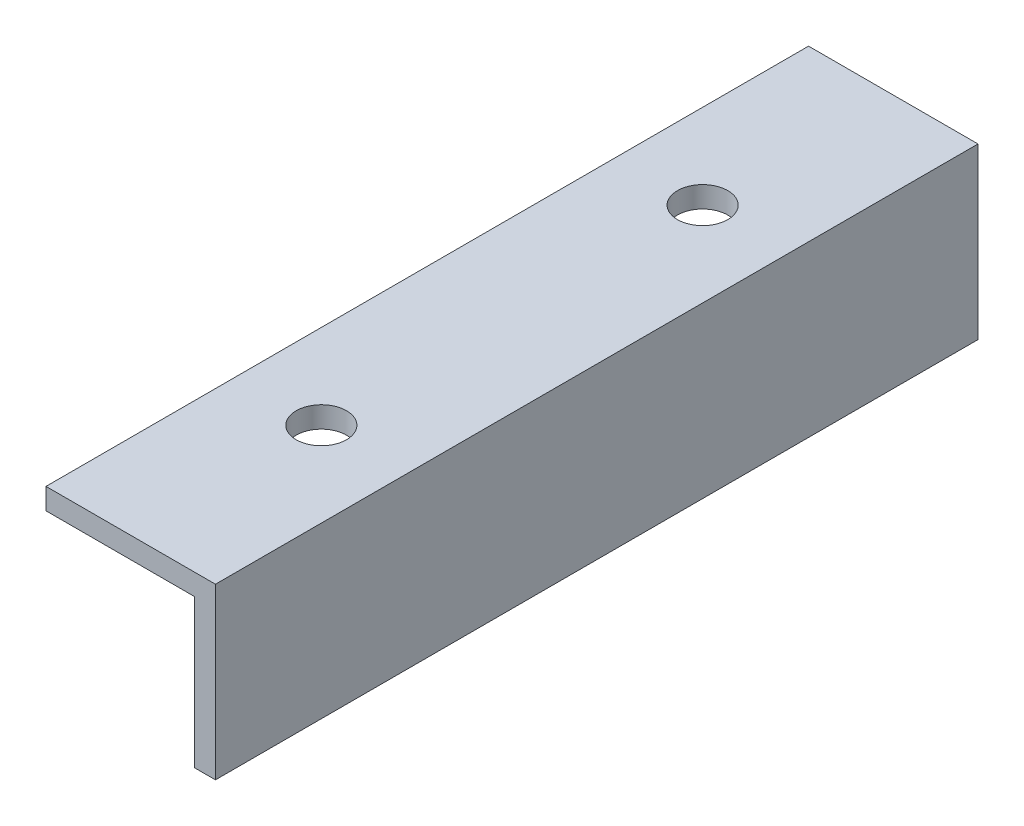
ISO-10303-21;
HEADER;
FILE_DESCRIPTION(('STEP AP214'),'2;1');
FILE_NAME('part.step','',(''),(''),'','','');
FILE_SCHEMA(('AUTOMOTIVE_DESIGN { 1 0 10303 214 1 1 1 1 }'));
ENDSEC;
DATA;
#1=APPLICATION_CONTEXT('core data for automotive mechanical design processes');
#2=APPLICATION_PROTOCOL_DEFINITION('international standard','automotive_design',2000,#1);
#3=PRODUCT_CONTEXT('',#1,'mechanical');
#4=PRODUCT('Part','Part','',(#3));
#5=PRODUCT_RELATED_PRODUCT_CATEGORY('part','',(#4));
#6=PRODUCT_DEFINITION_FORMATION('','',#4);
#7=PRODUCT_DEFINITION_CONTEXT('part definition',#1,'design');
#8=PRODUCT_DEFINITION('design','',#6,#7);
#9=PRODUCT_DEFINITION_SHAPE('','',#8);
#10=(LENGTH_UNIT() NAMED_UNIT(*) SI_UNIT(.MILLI.,.METRE.));
#11=(NAMED_UNIT(*) PLANE_ANGLE_UNIT() SI_UNIT($,.RADIAN.));
#12=(NAMED_UNIT(*) SI_UNIT($,.STERADIAN.) SOLID_ANGLE_UNIT());
#13=UNCERTAINTY_MEASURE_WITH_UNIT(LENGTH_MEASURE(1.E-05),#10,'distance_accuracy_value','');
#14=(GEOMETRIC_REPRESENTATION_CONTEXT(3) GLOBAL_UNCERTAINTY_ASSIGNED_CONTEXT((#13)) GLOBAL_UNIT_ASSIGNED_CONTEXT((#10,
#11,#12)) REPRESENTATION_CONTEXT('',''));
#15=CARTESIAN_POINT('',(0.,0.,0.));
#16=DIRECTION('',(0.,0.,1.));
#17=DIRECTION('',(1.,0.,0.));
#18=AXIS2_PLACEMENT_3D('',#15,#16,#17);
#19=CARTESIAN_POINT('',(0.,-1.5875,114.3));
#20=DIRECTION('',(1.,0.,0.));
#21=DIRECTION('',(0.,0.,-1.));
#22=AXIS2_PLACEMENT_3D('',#19,#20,#21);
#23=PLANE('',#22);
#24=DIRECTION('',(0.,-1.,0.));
#25=VECTOR('',#24,1.);
#26=CARTESIAN_POINT('',(0.,-1.5875,0.));
#27=LINE('',#26,#25);
#28=CARTESIAN_POINT('',(0.,0.,0.));
#29=VERTEX_POINT('',#28);
#30=CARTESIAN_POINT('',(0.,-3.175,0.));
#31=VERTEX_POINT('',#30);
#32=EDGE_CURVE('E130',#29,#31,#27,.T.);
#33=ORIENTED_EDGE('',*,*,#32,.T.);
#34=DIRECTION('',(0.,0.,-1.));
#35=VECTOR('',#34,1.);
#36=CARTESIAN_POINT('',(0.,-3.175,114.3));
#37=LINE('',#36,#35);
#38=CARTESIAN_POINT('',(0.,-3.175,114.3));
#39=VERTEX_POINT('',#38);
#40=EDGE_CURVE('E11',#39,#31,#37,.T.);
#41=ORIENTED_EDGE('',*,*,#40,.F.);
#42=DIRECTION('',(0.,-1.,0.));
#43=VECTOR('',#42,1.);
#44=CARTESIAN_POINT('',(0.,-1.5875,114.3));
#45=LINE('',#44,#43);
#46=CARTESIAN_POINT('',(0.,0.,114.3));
#47=VERTEX_POINT('',#46);
#48=EDGE_CURVE('E147',#47,#39,#45,.T.);
#49=ORIENTED_EDGE('',*,*,#48,.F.);
#50=DIRECTION('',(0.,0.,-1.));
#51=VECTOR('',#50,1.);
#52=CARTESIAN_POINT('',(0.,0.,114.3));
#53=LINE('',#52,#51);
#54=EDGE_CURVE('E40',#47,#29,#53,.T.);
#55=ORIENTED_EDGE('',*,*,#54,.T.);
#56=EDGE_LOOP('',(#33,#41,#49,#55));
#57=FACE_BOUND('',#56,.T.);
#58=ADVANCED_FACE('F16',(#57),#23,.F.);
#59=CARTESIAN_POINT('',(11.1125,-3.175,114.3));
#60=DIRECTION('',(0.,1.,0.));
#61=DIRECTION('',(0.,0.,1.));
#62=AXIS2_PLACEMENT_3D('',#59,#60,#61);
#63=PLANE('',#62);
#64=CARTESIAN_POINT('',(12.7,-3.175,28.575));
#65=DIRECTION('',(0.,1.,0.));
#66=DIRECTION('',(0.,0.,1.));
#67=AXIS2_PLACEMENT_3D('',#64,#65,#66);
#68=CIRCLE('',#67,3.7703125);
#69=CARTESIAN_POINT('',(12.7,-3.175,32.3453125));
#70=VERTEX_POINT('',#69);
#71=EDGE_CURVE('E19',#70,#70,#68,.F.);
#72=ORIENTED_EDGE('',*,*,#71,.F.);
#73=EDGE_LOOP('',(#72));
#74=FACE_BOUND('',#73,.T.);
#75=CARTESIAN_POINT('',(12.7,-3.175,85.725));
#76=DIRECTION('',(0.,1.,0.));
#77=DIRECTION('',(0.,0.,1.));
#78=AXIS2_PLACEMENT_3D('',#75,#76,#77);
#79=CIRCLE('',#78,3.7703125);
#80=CARTESIAN_POINT('',(12.7,-3.175,89.4953125));
#81=VERTEX_POINT('',#80);
#82=EDGE_CURVE('E134',#81,#81,#79,.F.);
#83=ORIENTED_EDGE('',*,*,#82,.F.);
#84=EDGE_LOOP('',(#83));
#85=FACE_BOUND('',#84,.T.);
#86=DIRECTION('',(1.,0.,0.));
#87=VECTOR('',#86,1.);
#88=CARTESIAN_POINT('',(11.1125,-3.175,0.));
#89=LINE('',#88,#87);
#90=CARTESIAN_POINT('',(22.225,-3.175,0.));
#91=VERTEX_POINT('',#90);
#92=EDGE_CURVE('E133',#31,#91,#89,.T.);
#93=ORIENTED_EDGE('',*,*,#92,.T.);
#94=DIRECTION('',(0.,0.,-1.));
#95=VECTOR('',#94,1.);
#96=CARTESIAN_POINT('',(22.225,-3.175,114.3));
#97=LINE('',#96,#95);
#98=CARTESIAN_POINT('',(22.225,-3.175,114.3));
#99=VERTEX_POINT('',#98);
#100=EDGE_CURVE('E26',#99,#91,#97,.T.);
#101=ORIENTED_EDGE('',*,*,#100,.F.);
#102=DIRECTION('',(1.,0.,0.));
#103=VECTOR('',#102,1.);
#104=CARTESIAN_POINT('',(11.1125,-3.175,114.3));
#105=LINE('',#104,#103);
#106=EDGE_CURVE('E82',#39,#99,#105,.T.);
#107=ORIENTED_EDGE('',*,*,#106,.F.);
#108=ORIENTED_EDGE('',*,*,#40,.T.);
#109=EDGE_LOOP('',(#93,#101,#107,#108));
#110=FACE_BOUND('',#109,.T.);
#111=ADVANCED_FACE('F226',(#74,#85,#110),#63,.F.);
#112=CARTESIAN_POINT('',(22.225,-14.2875,114.3));
#113=DIRECTION('',(1.,0.,0.));
#114=DIRECTION('',(0.,0.,-1.));
#115=AXIS2_PLACEMENT_3D('',#112,#113,#114);
#116=PLANE('',#115);
#117=DIRECTION('',(0.,-1.,0.));
#118=VECTOR('',#117,1.);
#119=CARTESIAN_POINT('',(22.225,-14.2875,0.));
#120=LINE('',#119,#118);
#121=CARTESIAN_POINT('',(22.225,-25.4,0.));
#122=VERTEX_POINT('',#121);
#123=EDGE_CURVE('E137',#91,#122,#120,.T.);
#124=ORIENTED_EDGE('',*,*,#123,.T.);
#125=DIRECTION('',(0.,0.,-1.));
#126=VECTOR('',#125,1.);
#127=CARTESIAN_POINT('',(22.225,-25.4,114.3));
#128=LINE('',#127,#126);
#129=CARTESIAN_POINT('',(22.225,-25.4,114.3));
#130=VERTEX_POINT('',#129);
#131=EDGE_CURVE('E117',#130,#122,#128,.T.);
#132=ORIENTED_EDGE('',*,*,#131,.F.);
#133=DIRECTION('',(0.,-1.,0.));
#134=VECTOR('',#133,1.);
#135=CARTESIAN_POINT('',(22.225,-14.2875,114.3));
#136=LINE('',#135,#134);
#137=EDGE_CURVE('E103',#99,#130,#136,.T.);
#138=ORIENTED_EDGE('',*,*,#137,.F.);
#139=ORIENTED_EDGE('',*,*,#100,.T.);
#140=EDGE_LOOP('',(#124,#132,#138,#139));
#141=FACE_BOUND('',#140,.T.);
#142=ADVANCED_FACE('F221',(#141),#116,.F.);
#143=CARTESIAN_POINT('',(23.8125,-25.4,114.3));
#144=DIRECTION('',(0.,1.,0.));
#145=DIRECTION('',(0.,0.,1.));
#146=AXIS2_PLACEMENT_3D('',#143,#144,#145);
#147=PLANE('',#146);
#148=DIRECTION('',(1.,0.,0.));
#149=VECTOR('',#148,1.);
#150=CARTESIAN_POINT('',(23.8125,-25.4,0.));
#151=LINE('',#150,#149);
#152=CARTESIAN_POINT('',(25.4,-25.4,0.));
#153=VERTEX_POINT('',#152);
#154=EDGE_CURVE('E113',#122,#153,#151,.T.);
#155=ORIENTED_EDGE('',*,*,#154,.T.);
#156=DIRECTION('',(0.,0.,-1.));
#157=VECTOR('',#156,1.);
#158=CARTESIAN_POINT('',(25.4,-25.4,114.3));
#159=LINE('',#158,#157);
#160=CARTESIAN_POINT('',(25.4,-25.4,114.3));
#161=VERTEX_POINT('',#160);
#162=EDGE_CURVE('E110',#161,#153,#159,.T.);
#163=ORIENTED_EDGE('',*,*,#162,.F.);
#164=DIRECTION('',(1.,0.,0.));
#165=VECTOR('',#164,1.);
#166=CARTESIAN_POINT('',(23.8125,-25.4,114.3));
#167=LINE('',#166,#165);
#168=EDGE_CURVE('E96',#130,#161,#167,.T.);
#169=ORIENTED_EDGE('',*,*,#168,.F.);
#170=ORIENTED_EDGE('',*,*,#131,.T.);
#171=EDGE_LOOP('',(#155,#163,#169,#170));
#172=FACE_BOUND('',#171,.T.);
#173=ADVANCED_FACE('F111',(#172),#147,.F.);
#174=CARTESIAN_POINT('',(25.4,-12.7,114.3));
#175=DIRECTION('',(1.,0.,0.));
#176=DIRECTION('',(0.,0.,-1.));
#177=AXIS2_PLACEMENT_3D('',#174,#175,#176);
#178=PLANE('',#177);
#179=DIRECTION('',(0.,-1.,0.));
#180=VECTOR('',#179,1.);
#181=CARTESIAN_POINT('',(25.4,-12.7,0.));
#182=LINE('',#181,#180);
#183=CARTESIAN_POINT('',(25.4,0.,0.));
#184=VERTEX_POINT('',#183);
#185=EDGE_CURVE('E141',#184,#153,#182,.T.);
#186=ORIENTED_EDGE('',*,*,#185,.F.);
#187=DIRECTION('',(0.,0.,-1.));
#188=VECTOR('',#187,1.);
#189=CARTESIAN_POINT('',(25.4,0.,114.3));
#190=LINE('',#189,#188);
#191=CARTESIAN_POINT('',(25.4,0.,114.3));
#192=VERTEX_POINT('',#191);
#193=EDGE_CURVE('E66',#192,#184,#190,.T.);
#194=ORIENTED_EDGE('',*,*,#193,.F.);
#195=DIRECTION('',(0.,-1.,0.));
#196=VECTOR('',#195,1.);
#197=CARTESIAN_POINT('',(25.4,-12.7,114.3));
#198=LINE('',#197,#196);
#199=EDGE_CURVE('E101',#192,#161,#198,.T.);
#200=ORIENTED_EDGE('',*,*,#199,.T.);
#201=ORIENTED_EDGE('',*,*,#162,.T.);
#202=EDGE_LOOP('',(#186,#194,#200,#201));
#203=FACE_BOUND('',#202,.T.);
#204=ADVANCED_FACE('F119',(#203),#178,.T.);
#205=CARTESIAN_POINT('',(12.7,0.,114.3));
#206=DIRECTION('',(0.,1.,0.));
#207=DIRECTION('',(0.,0.,1.));
#208=AXIS2_PLACEMENT_3D('',#205,#206,#207);
#209=PLANE('',#208);
#210=CARTESIAN_POINT('',(12.7,0.,28.575));
#211=DIRECTION('',(0.,1.,0.));
#212=DIRECTION('',(0.,0.,1.));
#213=AXIS2_PLACEMENT_3D('',#210,#211,#212);
#214=CIRCLE('',#213,3.7703125);
#215=CARTESIAN_POINT('',(12.7,0.,32.3453125));
#216=VERTEX_POINT('',#215);
#217=EDGE_CURVE('E171',#216,#216,#214,.T.);
#218=ORIENTED_EDGE('',*,*,#217,.F.);
#219=EDGE_LOOP('',(#218));
#220=FACE_BOUND('',#219,.T.);
#221=CARTESIAN_POINT('',(12.7,0.,85.725));
#222=DIRECTION('',(0.,1.,0.));
#223=DIRECTION('',(0.,0.,1.));
#224=AXIS2_PLACEMENT_3D('',#221,#222,#223);
#225=CIRCLE('',#224,3.7703125);
#226=CARTESIAN_POINT('',(12.7,0.,89.4953125));
#227=VERTEX_POINT('',#226);
#228=EDGE_CURVE('E157',#227,#227,#225,.T.);
#229=ORIENTED_EDGE('',*,*,#228,.F.);
#230=EDGE_LOOP('',(#229));
#231=FACE_BOUND('',#230,.T.);
#232=DIRECTION('',(1.,0.,0.));
#233=VECTOR('',#232,1.);
#234=CARTESIAN_POINT('',(12.7,0.,0.));
#235=LINE('',#234,#233);
#236=EDGE_CURVE('E143',#29,#184,#235,.T.);
#237=ORIENTED_EDGE('',*,*,#236,.F.);
#238=ORIENTED_EDGE('',*,*,#54,.F.);
#239=DIRECTION('',(1.,0.,0.));
#240=VECTOR('',#239,1.);
#241=CARTESIAN_POINT('',(12.7,0.,114.3));
#242=LINE('',#241,#240);
#243=EDGE_CURVE('E121',#47,#192,#242,.T.);
#244=ORIENTED_EDGE('',*,*,#243,.T.);
#245=ORIENTED_EDGE('',*,*,#193,.T.);
#246=EDGE_LOOP('',(#237,#238,#244,#245));
#247=FACE_BOUND('',#246,.T.);
#248=ADVANCED_FACE('F206',(#220,#231,#247),#209,.T.);
#249=CARTESIAN_POINT('',(12.7,-12.7,114.3));
#250=DIRECTION('',(0.,0.,1.));
#251=DIRECTION('',(1.,0.,0.));
#252=AXIS2_PLACEMENT_3D('',#249,#250,#251);
#253=PLANE('',#252);
#254=ORIENTED_EDGE('',*,*,#48,.T.);
#255=ORIENTED_EDGE('',*,*,#106,.T.);
#256=ORIENTED_EDGE('',*,*,#137,.T.);
#257=ORIENTED_EDGE('',*,*,#168,.T.);
#258=ORIENTED_EDGE('',*,*,#199,.F.);
#259=ORIENTED_EDGE('',*,*,#243,.F.);
#260=EDGE_LOOP('',(#254,#255,#256,#257,#258,#259));
#261=FACE_BOUND('',#260,.T.);
#262=ADVANCED_FACE('F98',(#261),#253,.T.);
#263=CARTESIAN_POINT('',(12.7,-12.7,0.));
#264=DIRECTION('',(0.,0.,1.));
#265=DIRECTION('',(1.,0.,0.));
#266=AXIS2_PLACEMENT_3D('',#263,#264,#265);
#267=PLANE('',#266);
#268=ORIENTED_EDGE('',*,*,#32,.F.);
#269=ORIENTED_EDGE('',*,*,#236,.T.);
#270=ORIENTED_EDGE('',*,*,#185,.T.);
#271=ORIENTED_EDGE('',*,*,#154,.F.);
#272=ORIENTED_EDGE('',*,*,#123,.F.);
#273=ORIENTED_EDGE('',*,*,#92,.F.);
#274=EDGE_LOOP('',(#268,#269,#270,#271,#272,#273));
#275=FACE_BOUND('',#274,.T.);
#276=ADVANCED_FACE('F189',(#275),#267,.F.);
#277=CARTESIAN_POINT('',(12.7,-120.944276528458,85.725));
#278=DIRECTION('',(0.,1.,0.));
#279=DIRECTION('',(0.,0.,1.));
#280=AXIS2_PLACEMENT_3D('',#277,#278,#279);
#281=CYLINDRICAL_SURFACE('',#280,3.7703125);
#282=ORIENTED_EDGE('',*,*,#228,.T.);
#283=EDGE_LOOP('',(#282));
#284=FACE_BOUND('',#283,.T.);
#285=ORIENTED_EDGE('',*,*,#82,.T.);
#286=EDGE_LOOP('',(#285));
#287=FACE_BOUND('',#286,.T.);
#288=ADVANCED_FACE('F194',(#284,#287),#281,.F.);
#289=CARTESIAN_POINT('',(12.7,-120.944276528458,28.575));
#290=DIRECTION('',(0.,1.,0.));
#291=DIRECTION('',(0.,0.,1.));
#292=AXIS2_PLACEMENT_3D('',#289,#290,#291);
#293=CYLINDRICAL_SURFACE('',#292,3.7703125);
#294=ORIENTED_EDGE('',*,*,#217,.T.);
#295=EDGE_LOOP('',(#294));
#296=FACE_BOUND('',#295,.T.);
#297=ORIENTED_EDGE('',*,*,#71,.T.);
#298=EDGE_LOOP('',(#297));
#299=FACE_BOUND('',#298,.T.);
#300=ADVANCED_FACE('F310',(#296,#299),#293,.F.);
#301=CLOSED_SHELL('',(#58,#111,#142,#173,#204,#248,#262,#276,#288,#300));
#302=MANIFOLD_SOLID_BREP('B1',#301);
#303=ADVANCED_BREP_SHAPE_REPRESENTATION('',(#18,#302),#14);
#304=SHAPE_DEFINITION_REPRESENTATION(#9,#303);
ENDSEC;
END-ISO-10303-21;
